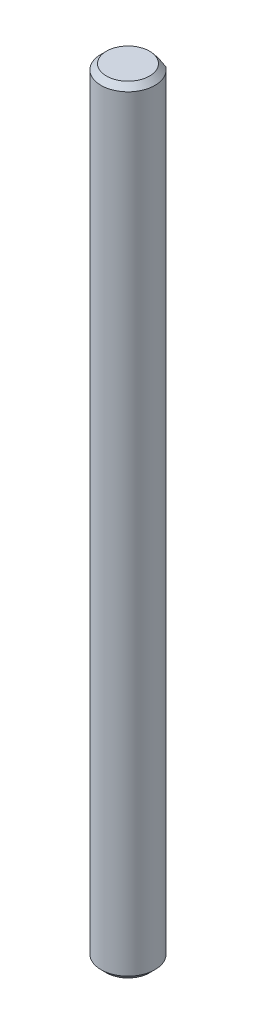
ISO-10303-21;
HEADER;
FILE_DESCRIPTION(('STEP AP214'),'2;1');
FILE_NAME('part.step','',(''),(''),'','','');
FILE_SCHEMA(('AUTOMOTIVE_DESIGN { 1 0 10303 214 1 1 1 1 }'));
ENDSEC;
DATA;
#1=APPLICATION_CONTEXT('core data for automotive mechanical design processes');
#2=APPLICATION_PROTOCOL_DEFINITION('international standard','automotive_design',2000,#1);
#3=PRODUCT_CONTEXT('',#1,'mechanical');
#4=PRODUCT('Part','Part','',(#3));
#5=PRODUCT_RELATED_PRODUCT_CATEGORY('part','',(#4));
#6=PRODUCT_DEFINITION_FORMATION('','',#4);
#7=PRODUCT_DEFINITION_CONTEXT('part definition',#1,'design');
#8=PRODUCT_DEFINITION('design','',#6,#7);
#9=PRODUCT_DEFINITION_SHAPE('','',#8);
#10=(LENGTH_UNIT() NAMED_UNIT(*) SI_UNIT(.MILLI.,.METRE.));
#11=(NAMED_UNIT(*) PLANE_ANGLE_UNIT() SI_UNIT($,.RADIAN.));
#12=(NAMED_UNIT(*) SI_UNIT($,.STERADIAN.) SOLID_ANGLE_UNIT());
#13=UNCERTAINTY_MEASURE_WITH_UNIT(LENGTH_MEASURE(1.E-05),#10,'distance_accuracy_value','');
#14=(GEOMETRIC_REPRESENTATION_CONTEXT(3) GLOBAL_UNCERTAINTY_ASSIGNED_CONTEXT((#13)) GLOBAL_UNIT_ASSIGNED_CONTEXT((#10,
#11,#12)) REPRESENTATION_CONTEXT('',''));
#15=CARTESIAN_POINT('',(0.,0.,0.));
#16=DIRECTION('',(0.,0.,1.));
#17=DIRECTION('',(1.,0.,0.));
#18=AXIS2_PLACEMENT_3D('',#15,#16,#17);
#19=CARTESIAN_POINT('',(0.,72.,0.));
#20=DIRECTION('',(0.,-1.,0.));
#21=DIRECTION('',(0.,0.,-1.));
#22=AXIS2_PLACEMENT_3D('',#19,#20,#21);
#23=CYLINDRICAL_SURFACE('',#22,2.5);
#24=CARTESIAN_POINT('',(0.,0.5,0.));
#25=DIRECTION('',(0.,1.,0.));
#26=DIRECTION('',(0.,0.,1.));
#27=AXIS2_PLACEMENT_3D('',#24,#25,#26);
#28=CIRCLE('',#27,2.5);
#29=CARTESIAN_POINT('',(0.,0.5,2.5));
#30=VERTEX_POINT('',#29);
#31=EDGE_CURVE('E94',#30,#30,#28,.T.);
#32=ORIENTED_EDGE('',*,*,#31,.T.);
#33=EDGE_LOOP('',(#32));
#34=FACE_BOUND('',#33,.T.);
#35=DIRECTION('',(0.,1.,0.));
#36=VECTOR('',#35,1.);
#37=CARTESIAN_POINT('',(1.5,57.,-2.));
#38=LINE('',#37,#36);
#39=CARTESIAN_POINT('',(1.5,57.,-2.));
#40=VERTEX_POINT('',#39);
#41=CARTESIAN_POINT('',(1.5,71.5,-2.));
#42=VERTEX_POINT('',#41);
#43=EDGE_CURVE('E83',#40,#42,#38,.T.);
#44=ORIENTED_EDGE('',*,*,#43,.T.);
#45=CARTESIAN_POINT('',(0.,71.5,0.));
#46=DIRECTION('',(0.,1.,0.));
#47=DIRECTION('',(0.,0.,1.));
#48=AXIS2_PLACEMENT_3D('',#45,#46,#47);
#49=CIRCLE('',#48,2.5);
#50=CARTESIAN_POINT('',(-1.5,71.5,-2.));
#51=VERTEX_POINT('',#50);
#52=EDGE_CURVE('E86',#42,#51,#49,.F.);
#53=ORIENTED_EDGE('',*,*,#52,.T.);
#54=DIRECTION('',(0.,1.,0.));
#55=VECTOR('',#54,1.);
#56=CARTESIAN_POINT('',(-1.5,57.,-2.));
#57=LINE('',#56,#55);
#58=CARTESIAN_POINT('',(-1.5,57.,-2.));
#59=VERTEX_POINT('',#58);
#60=EDGE_CURVE('E81',#59,#51,#57,.T.);
#61=ORIENTED_EDGE('',*,*,#60,.F.);
#62=CARTESIAN_POINT('',(0.,57.,0.));
#63=DIRECTION('',(0.,1.,0.));
#64=DIRECTION('',(0.,0.,1.));
#65=AXIS2_PLACEMENT_3D('',#62,#63,#64);
#66=CIRCLE('',#65,2.5);
#67=EDGE_CURVE('E71',#40,#59,#66,.T.);
#68=ORIENTED_EDGE('',*,*,#67,.F.);
#69=EDGE_LOOP('',(#44,#53,#61,#68));
#70=FACE_BOUND('',#69,.T.);
#71=ADVANCED_FACE('F36',(#34,#70),#23,.T.);
#72=CARTESIAN_POINT('',(0.,72.,0.));
#73=DIRECTION('',(0.,1.,0.));
#74=DIRECTION('',(0.,0.,1.));
#75=AXIS2_PLACEMENT_3D('',#72,#73,#74);
#76=PLANE('',#75);
#77=CARTESIAN_POINT('',(0.,72.,0.));
#78=DIRECTION('',(0.,1.,0.));
#79=DIRECTION('',(0.,0.,1.));
#80=AXIS2_PLACEMENT_3D('',#77,#78,#79);
#81=CIRCLE('',#80,2.);
#82=CARTESIAN_POINT('',(0.,72.,-2.));
#83=VERTEX_POINT('',#82);
#84=EDGE_CURVE('E102',#83,#83,#81,.T.);
#85=ORIENTED_EDGE('',*,*,#84,.T.);
#86=EDGE_LOOP('',(#85));
#87=FACE_BOUND('',#86,.T.);
#88=ADVANCED_FACE('F114',(#87),#76,.T.);
#89=CARTESIAN_POINT('',(0.,0.,0.));
#90=DIRECTION('',(0.,1.,0.));
#91=DIRECTION('',(0.,0.,1.));
#92=AXIS2_PLACEMENT_3D('',#89,#90,#91);
#93=PLANE('',#92);
#94=CARTESIAN_POINT('',(0.,0.,0.));
#95=DIRECTION('',(0.,1.,0.));
#96=DIRECTION('',(0.,0.,1.));
#97=AXIS2_PLACEMENT_3D('',#94,#95,#96);
#98=CIRCLE('',#97,2.00000000000001);
#99=CARTESIAN_POINT('',(0.,0.,2.00000000000001));
#100=VERTEX_POINT('',#99);
#101=EDGE_CURVE('E98',#100,#100,#98,.F.);
#102=ORIENTED_EDGE('',*,*,#101,.T.);
#103=EDGE_LOOP('',(#102));
#104=FACE_BOUND('',#103,.T.);
#105=ADVANCED_FACE('F113',(#104),#93,.F.);
#106=CARTESIAN_POINT('',(-1.5,57.,-2.));
#107=DIRECTION('',(0.,0.,1.));
#108=DIRECTION('',(1.,0.,0.));
#109=AXIS2_PLACEMENT_3D('',#106,#107,#108);
#110=PLANE('',#109);
#111=CARTESIAN_POINT('',(-1.5,71.5,-2.));
#112=CARTESIAN_POINT('',(-1.42763018659213,71.5433736980276,-2.));
#113=CARTESIAN_POINT('',(-1.35436226532257,71.5853687019536,-2.));
#114=CARTESIAN_POINT('',(-1.20549660628808,71.6656443583189,-2.));
#115=CARTESIAN_POINT('',(-1.12989157710705,71.7039114197061,-2.));
#116=CARTESIAN_POINT('',(-0.978296734874824,71.774534191742,-2.));
#117=CARTESIAN_POINT('',(-0.902366736266397,71.8070165390548,-2.));
#118=CARTESIAN_POINT('',(-0.748220644904058,71.8658090166989,-2.));
#119=CARTESIAN_POINT('',(-0.670007876047688,71.8921276624893,-2.));
#120=CARTESIAN_POINT('',(-0.54306060001923,71.9280861032667,-2.));
#121=CARTESIAN_POINT('',(-0.49502116350363,71.9401901027996,-2.));
#122=CARTESIAN_POINT('',(-0.398260419217574,71.9612794306282,-2.));
#123=CARTESIAN_POINT('',(-0.349539198139846,71.9702651517484,-2.));
#124=CARTESIAN_POINT('',(-0.250852177401952,71.984927124024,-2.));
#125=CARTESIAN_POINT('',(-0.200878654038625,71.9905520018212,-2.));
#126=CARTESIAN_POINT('',(-0.100607619276168,71.9981023484678,-2.));
#127=CARTESIAN_POINT('',(-0.0503098472705244,72.0000243314446,-2.));
#128=CARTESIAN_POINT('',(0.,72.,-2.));
#129=B_SPLINE_CURVE_WITH_KNOTS('',3,(#111,#112,#113,#114,#115,#116,#117,#118,#119,#120,#121,
#122,#123,#124,#125,#126,#127,#128),.UNSPECIFIED.,.F.,.F.,(4,2,2,2,2,2,2,2,4),(0.,
0.253195034695598,0.507281075974293,0.754837752612891,1.00205037282503,1.15058504578389,
1.29910100031798,1.44983263801686,1.600706103947),.UNSPECIFIED.);
#130=EDGE_CURVE('E50',#51,#83,#129,.T.);
#131=ORIENTED_EDGE('',*,*,#130,.T.);
#132=CARTESIAN_POINT('',(0.,72.,-2.));
#133=CARTESIAN_POINT('',(0.0614966481035618,72.0000514930088,-2.));
#134=CARTESIAN_POINT('',(0.12296179611878,71.997164788165,-2.));
#135=CARTESIAN_POINT('',(0.245274670057059,71.9859212389057,-2.));
#136=CARTESIAN_POINT('',(0.306123362775479,71.9775750221521,-2.));
#137=CARTESIAN_POINT('',(0.425885509906891,71.9559969816614,-2.));
#138=CARTESIAN_POINT('',(0.484814317272308,71.9428488248966,-2.));
#139=CARTESIAN_POINT('',(0.601555526074532,71.9122507618696,-2.));
#140=CARTESIAN_POINT('',(0.659367456410753,71.8947990813251,-2.));
#141=CARTESIAN_POINT('',(0.784576263433314,71.8525702057821,-2.));
#142=CARTESIAN_POINT('',(0.85171451076066,71.8270315815753,-2.));
#143=CARTESIAN_POINT('',(0.98425002457692,71.7717452055525,-2.));
#144=CARTESIAN_POINT('',(1.04964642506796,71.7419954048129,-2.));
#145=CARTESIAN_POINT('',(1.18016546542206,71.6784785026746,-2.));
#146=CARTESIAN_POINT('',(1.24525271545219,71.6446394298057,-2.));
#147=CARTESIAN_POINT('',(1.37378197006118,71.5742160914667,-2.));
#148=CARTESIAN_POINT('',(1.43722666174302,71.5376367483736,-2.));
#149=CARTESIAN_POINT('',(1.5,71.5,-2.));
#150=B_SPLINE_CURVE_WITH_KNOTS('',3,(#132,#133,#134,#135,#136,#137,#138,#139,#140,#141,#142,
#143,#144,#145,#146,#147,#148,#149),.UNSPECIFIED.,.F.,.F.,(4,2,2,2,2,2,2,2,4),(0.,
0.184371949240826,0.368386057907037,0.549336051664291,0.730360773654887,0.945674044871395,
1.16109243790836,1.38109142427278,1.60070428639641),.UNSPECIFIED.);
#151=EDGE_CURVE('E11',#83,#42,#150,.T.);
#152=ORIENTED_EDGE('',*,*,#151,.T.);
#153=ORIENTED_EDGE('',*,*,#43,.F.);
#154=DIRECTION('',(1.,0.,0.));
#155=VECTOR('',#154,1.);
#156=CARTESIAN_POINT('',(-1.5,57.,-2.));
#157=LINE('',#156,#155);
#158=EDGE_CURVE('E74',#59,#40,#157,.T.);
#159=ORIENTED_EDGE('',*,*,#158,.F.);
#160=ORIENTED_EDGE('',*,*,#60,.T.);
#161=EDGE_LOOP('',(#131,#152,#153,#159,#160));
#162=FACE_BOUND('',#161,.T.);
#163=ADVANCED_FACE('F80',(#162),#110,.F.);
#164=CARTESIAN_POINT('',(0.,57.,0.));
#165=DIRECTION('',(0.,1.,0.));
#166=DIRECTION('',(0.,0.,1.));
#167=AXIS2_PLACEMENT_3D('',#164,#165,#166);
#168=PLANE('',#167);
#169=ORIENTED_EDGE('',*,*,#67,.T.);
#170=ORIENTED_EDGE('',*,*,#158,.T.);
#171=EDGE_LOOP('',(#169,#170));
#172=FACE_BOUND('',#171,.T.);
#173=ADVANCED_FACE('F73',(#172),#168,.T.);
#174=CARTESIAN_POINT('',(0.,0.5,0.));
#175=DIRECTION('',(0.,1.,0.));
#176=DIRECTION('',(0.,0.,1.));
#177=AXIS2_PLACEMENT_3D('',#174,#175,#176);
#178=CONICAL_SURFACE('',#177,2.5,0.785398163397439);
#179=ORIENTED_EDGE('',*,*,#101,.F.);
#180=EDGE_LOOP('',(#179));
#181=FACE_BOUND('',#180,.T.);
#182=ORIENTED_EDGE('',*,*,#31,.F.);
#183=EDGE_LOOP('',(#182));
#184=FACE_BOUND('',#183,.T.);
#185=ADVANCED_FACE('F124',(#181,#184),#178,.T.);
#186=CARTESIAN_POINT('',(0.,72.,0.));
#187=DIRECTION('',(0.,-1.,0.));
#188=DIRECTION('',(0.,0.,-1.));
#189=AXIS2_PLACEMENT_3D('',#186,#187,#188);
#190=CONICAL_SURFACE('',#189,2.,0.785398163397446);
#191=ORIENTED_EDGE('',*,*,#130,.F.);
#192=ORIENTED_EDGE('',*,*,#52,.F.);
#193=ORIENTED_EDGE('',*,*,#151,.F.);
#194=ORIENTED_EDGE('',*,*,#84,.F.);
#195=EDGE_LOOP('',(#191,#192,#193,#194));
#196=FACE_BOUND('',#195,.T.);
#197=ADVANCED_FACE('F38',(#196),#190,.T.);
#198=CLOSED_SHELL('',(#71,#88,#105,#163,#173,#185,#197));
#199=MANIFOLD_SOLID_BREP('B2',#198);
#200=ADVANCED_BREP_SHAPE_REPRESENTATION('',(#18,#199),#14);
#201=SHAPE_DEFINITION_REPRESENTATION(#9,#200);
ENDSEC;
END-ISO-10303-21;
